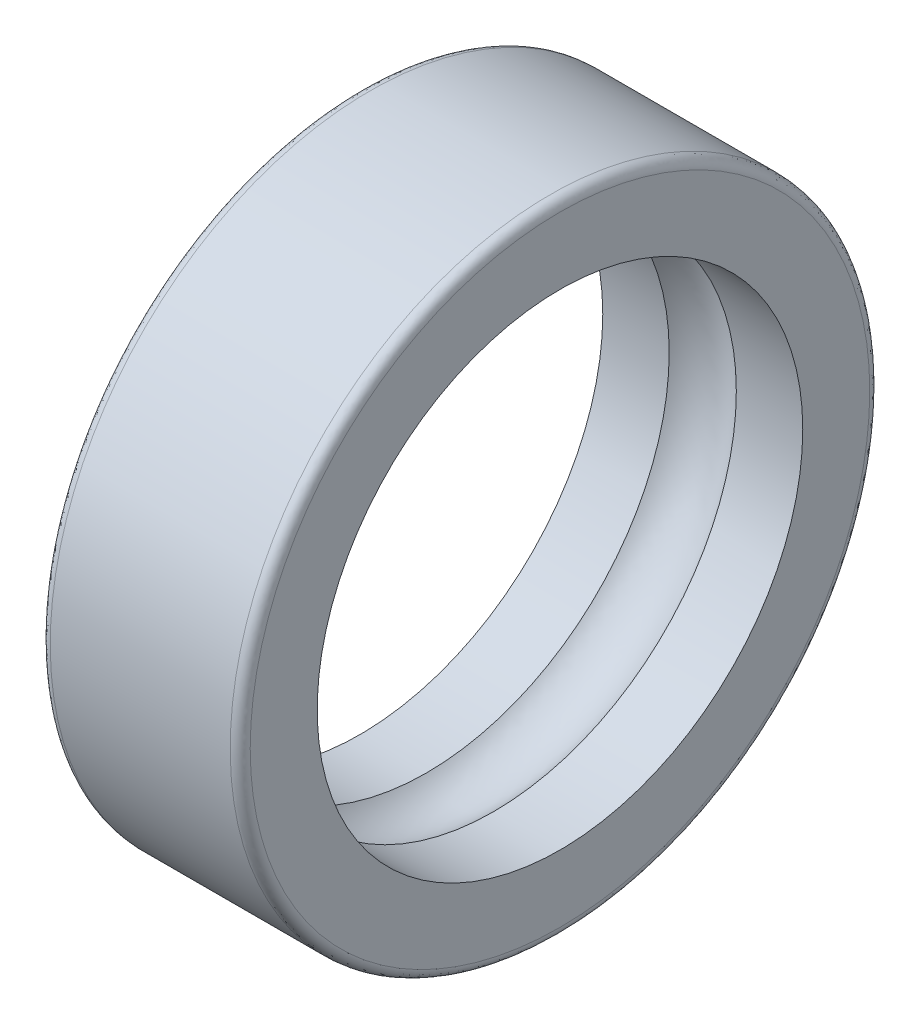
ISO-10303-21;
HEADER;
FILE_DESCRIPTION(('STEP AP214'),'2;1');
FILE_NAME('part.step','',(''),(''),'','','');
FILE_SCHEMA(('AUTOMOTIVE_DESIGN { 1 0 10303 214 1 1 1 1 }'));
ENDSEC;
DATA;
#1=APPLICATION_CONTEXT('core data for automotive mechanical design processes');
#2=APPLICATION_PROTOCOL_DEFINITION('international standard','automotive_design',2000,#1);
#3=PRODUCT_CONTEXT('',#1,'mechanical');
#4=PRODUCT('Part','Part','',(#3));
#5=PRODUCT_RELATED_PRODUCT_CATEGORY('part','',(#4));
#6=PRODUCT_DEFINITION_FORMATION('','',#4);
#7=PRODUCT_DEFINITION_CONTEXT('part definition',#1,'design');
#8=PRODUCT_DEFINITION('design','',#6,#7);
#9=PRODUCT_DEFINITION_SHAPE('','',#8);
#10=(LENGTH_UNIT() NAMED_UNIT(*) SI_UNIT(.MILLI.,.METRE.));
#11=(NAMED_UNIT(*) PLANE_ANGLE_UNIT() SI_UNIT($,.RADIAN.));
#12=(NAMED_UNIT(*) SI_UNIT($,.STERADIAN.) SOLID_ANGLE_UNIT());
#13=UNCERTAINTY_MEASURE_WITH_UNIT(LENGTH_MEASURE(1.E-05),#10,'distance_accuracy_value','');
#14=(GEOMETRIC_REPRESENTATION_CONTEXT(3) GLOBAL_UNCERTAINTY_ASSIGNED_CONTEXT((#13)) GLOBAL_UNIT_ASSIGNED_CONTEXT((#10,
#11,#12)) REPRESENTATION_CONTEXT('',''));
#15=CARTESIAN_POINT('',(0.,0.,0.));
#16=DIRECTION('',(0.,0.,1.));
#17=DIRECTION('',(1.,0.,0.));
#18=AXIS2_PLACEMENT_3D('',#15,#16,#17);
#19=CARTESIAN_POINT('',(-2.25171,0.,0.));
#20=DIRECTION('',(1.,0.,0.));
#21=DIRECTION('',(0.,0.,-1.));
#22=AXIS2_PLACEMENT_3D('',#19,#20,#21);
#23=CYLINDRICAL_SURFACE('',#22,8.001);
#24=CARTESIAN_POINT('',(2.25171,0.,0.));
#25=DIRECTION('',(1.,0.,0.));
#26=DIRECTION('',(0.,-1.,0.));
#27=AXIS2_PLACEMENT_3D('',#24,#25,#26);
#28=CIRCLE('',#27,8.00099999999999);
#29=CARTESIAN_POINT('',(2.25171,-8.00099999999999,0.));
#30=VERTEX_POINT('',#29);
#31=EDGE_CURVE('E106',#30,#30,#28,.F.);
#32=ORIENTED_EDGE('',*,*,#31,.T.);
#33=EDGE_LOOP('',(#32));
#34=FACE_BOUND('',#33,.T.);
#35=CARTESIAN_POINT('',(-2.25171,0.,0.));
#36=DIRECTION('',(1.,0.,0.));
#37=DIRECTION('',(0.,-1.,0.));
#38=AXIS2_PLACEMENT_3D('',#35,#36,#37);
#39=CIRCLE('',#38,8.00099999999999);
#40=CARTESIAN_POINT('',(-2.25171,-8.00099999999999,0.));
#41=VERTEX_POINT('',#40);
#42=EDGE_CURVE('E54',#41,#41,#39,.T.);
#43=ORIENTED_EDGE('',*,*,#42,.T.);
#44=EDGE_LOOP('',(#43));
#45=FACE_BOUND('',#44,.T.);
#46=ADVANCED_FACE('F17',(#34,#45),#23,.T.);
#47=CARTESIAN_POINT('',(2.223955035402,-7.99945572797488,0.));
#48=CARTESIAN_POINT('',(2.39671908490918,-8.01874043524467,0.));
#49=CARTESIAN_POINT('',(2.51964043524467,-7.89581908490918,0.));
#50=CARTESIAN_POINT('',(2.50035572797488,-7.723055035402,0.));
#51=(BOUNDED_CURVE() B_SPLINE_CURVE(3,(#47,#48,#49,#50),.UNSPECIFIED.,.F.,
.F.) B_SPLINE_CURVE_WITH_KNOTS((4,4),(0.,1.),
.UNSPECIFIED.) CURVE() GEOMETRIC_REPRESENTATION_ITEM() RATIONAL_B_SPLINE_CURVE((1.,
0.749532639687892,0.749532639687892,1.)) REPRESENTATION_ITEM(''));
#52=CARTESIAN_POINT('',(2.25171,0.,0.));
#53=DIRECTION('',(1.,0.,0.));
#54=AXIS1_PLACEMENT('',#52,#53);
#55=SURFACE_OF_REVOLUTION('',#51,#54);
#56=ORIENTED_EDGE('',*,*,#31,.F.);
#57=EDGE_LOOP('',(#56));
#58=FACE_BOUND('',#57,.T.);
#59=CARTESIAN_POINT('',(2.50189999999999,0.,0.));
#60=DIRECTION('',(-1.,0.,0.));
#61=DIRECTION('',(0.,1.,0.));
#62=AXIS2_PLACEMENT_3D('',#59,#60,#61);
#63=CIRCLE('',#62,7.75081);
#64=CARTESIAN_POINT('',(2.50189999999999,7.75081,0.));
#65=VERTEX_POINT('',#64);
#66=CARTESIAN_POINT('',(2.50189999999999,-7.75081,0.));
#67=VERTEX_POINT('',#66);
#68=EDGE_CURVE('E47',#65,#67,#63,.T.);
#69=ORIENTED_EDGE('',*,*,#68,.T.);
#70=CARTESIAN_POINT('',(2.50189999999999,0.,0.));
#71=DIRECTION('',(-1.,0.,0.));
#72=DIRECTION('',(0.,-1.,0.));
#73=AXIS2_PLACEMENT_3D('',#70,#71,#72);
#74=CIRCLE('',#73,7.75081);
#75=EDGE_CURVE('E50',#67,#65,#74,.T.);
#76=ORIENTED_EDGE('',*,*,#75,.T.);
#77=EDGE_LOOP('',(#69,#76));
#78=FACE_BOUND('',#77,.T.);
#79=ADVANCED_FACE('F51',(#58,#78),#55,.T.);
#80=CARTESIAN_POINT('',(-2.50035572797488,-7.723055035402,0.));
#81=CARTESIAN_POINT('',(-2.51964043524467,-7.89581908490918,0.));
#82=CARTESIAN_POINT('',(-2.39671908490918,-8.01874043524467,0.));
#83=CARTESIAN_POINT('',(-2.223955035402,-7.99945572797488,0.));
#84=(BOUNDED_CURVE() B_SPLINE_CURVE(3,(#80,#81,#82,#83),.UNSPECIFIED.,.F.,
.F.) B_SPLINE_CURVE_WITH_KNOTS((4,4),(0.,1.),
.UNSPECIFIED.) CURVE() GEOMETRIC_REPRESENTATION_ITEM() RATIONAL_B_SPLINE_CURVE((1.,
0.749532639687893,0.749532639687893,1.)) REPRESENTATION_ITEM(''));
#85=CARTESIAN_POINT('',(-2.25171,0.,0.));
#86=DIRECTION('',(1.,0.,0.));
#87=AXIS1_PLACEMENT('',#85,#86);
#88=SURFACE_OF_REVOLUTION('',#84,#87);
#89=ORIENTED_EDGE('',*,*,#42,.F.);
#90=EDGE_LOOP('',(#89));
#91=FACE_BOUND('',#90,.T.);
#92=CARTESIAN_POINT('',(-2.50189999999999,0.,0.));
#93=DIRECTION('',(1.,0.,0.));
#94=DIRECTION('',(0.,1.,0.));
#95=AXIS2_PLACEMENT_3D('',#92,#93,#94);
#96=CIRCLE('',#95,7.75081);
#97=CARTESIAN_POINT('',(-2.50189999999999,7.75081,0.));
#98=VERTEX_POINT('',#97);
#99=CARTESIAN_POINT('',(-2.50189999999999,-7.75081,0.));
#100=VERTEX_POINT('',#99);
#101=EDGE_CURVE('E113',#98,#100,#96,.T.);
#102=ORIENTED_EDGE('',*,*,#101,.T.);
#103=CARTESIAN_POINT('',(-2.50189999999999,0.,0.));
#104=DIRECTION('',(1.,0.,0.));
#105=DIRECTION('',(0.,-1.,0.));
#106=AXIS2_PLACEMENT_3D('',#103,#104,#105);
#107=CIRCLE('',#106,7.75081);
#108=EDGE_CURVE('E38',#100,#98,#107,.T.);
#109=ORIENTED_EDGE('',*,*,#108,.T.);
#110=EDGE_LOOP('',(#102,#109));
#111=FACE_BOUND('',#110,.T.);
#112=ADVANCED_FACE('F74',(#91,#111),#88,.T.);
#113=CARTESIAN_POINT('',(2.5019,8.0608424,8.06392032693786));
#114=DIRECTION('',(1.,0.,0.));
#115=DIRECTION('',(0.,-1.,0.));
#116=AXIS2_PLACEMENT_3D('',#113,#114,#115);
#117=PLANE('',#116);
#118=CARTESIAN_POINT('',(2.5019,0.,0.));
#119=DIRECTION('',(1.,0.,0.));
#120=DIRECTION('',(0.,0.,-1.));
#121=AXIS2_PLACEMENT_3D('',#118,#119,#120);
#122=CIRCLE('',#121,6.0745751);
#123=CARTESIAN_POINT('',(2.5019,0.,-6.0745751));
#124=VERTEX_POINT('',#123);
#125=EDGE_CURVE('E117',#124,#124,#122,.F.);
#126=ORIENTED_EDGE('',*,*,#125,.T.);
#127=EDGE_LOOP('',(#126));
#128=FACE_BOUND('',#127,.T.);
#129=ORIENTED_EDGE('',*,*,#75,.F.);
#130=ORIENTED_EDGE('',*,*,#68,.F.);
#131=EDGE_LOOP('',(#129,#130));
#132=FACE_BOUND('',#131,.T.);
#133=ADVANCED_FACE('F57',(#128,#132),#117,.T.);
#134=CARTESIAN_POINT('',(-2.5019,8.0608424,8.06392032693786));
#135=DIRECTION('',(1.,0.,0.));
#136=DIRECTION('',(0.,-1.,0.));
#137=AXIS2_PLACEMENT_3D('',#134,#135,#136);
#138=PLANE('',#137);
#139=CARTESIAN_POINT('',(-2.5019,0.,0.));
#140=DIRECTION('',(1.,0.,0.));
#141=DIRECTION('',(0.,0.,-1.));
#142=AXIS2_PLACEMENT_3D('',#139,#140,#141);
#143=CIRCLE('',#142,6.0745751);
#144=CARTESIAN_POINT('',(-2.5019,0.,-6.0745751));
#145=VERTEX_POINT('',#144);
#146=EDGE_CURVE('E148',#145,#145,#143,.T.);
#147=ORIENTED_EDGE('',*,*,#146,.T.);
#148=EDGE_LOOP('',(#147));
#149=FACE_BOUND('',#148,.T.);
#150=ORIENTED_EDGE('',*,*,#108,.F.);
#151=ORIENTED_EDGE('',*,*,#101,.F.);
#152=EDGE_LOOP('',(#150,#151));
#153=FACE_BOUND('',#152,.T.);
#154=ADVANCED_FACE('F19',(#149,#153),#138,.F.);
#155=CARTESIAN_POINT('',(0.839755569912476,0.,0.));
#156=DIRECTION('',(1.,0.,0.));
#157=DIRECTION('',(0.,0.,-1.));
#158=AXIS2_PLACEMENT_3D('',#155,#156,#157);
#159=CYLINDRICAL_SURFACE('',#158,6.0745751);
#160=ORIENTED_EDGE('',*,*,#125,.F.);
#161=EDGE_LOOP('',(#160));
#162=FACE_BOUND('',#161,.T.);
#163=CARTESIAN_POINT('',(0.839755569912455,0.,0.));
#164=DIRECTION('',(1.,0.,0.));
#165=DIRECTION('',(0.,-1.,0.));
#166=AXIS2_PLACEMENT_3D('',#163,#164,#165);
#167=CIRCLE('',#166,6.07457509999998);
#168=CARTESIAN_POINT('',(0.839755569912455,-6.07457509999998,0.));
#169=VERTEX_POINT('',#168);
#170=EDGE_CURVE('E30',#169,#169,#167,.F.);
#171=ORIENTED_EDGE('',*,*,#170,.T.);
#172=EDGE_LOOP('',(#171));
#173=FACE_BOUND('',#172,.T.);
#174=ADVANCED_FACE('F119',(#162,#173),#159,.F.);
#175=CARTESIAN_POINT('',(-2.5019,0.,0.));
#176=DIRECTION('',(1.,0.,0.));
#177=DIRECTION('',(0.,0.,-1.));
#178=AXIS2_PLACEMENT_3D('',#175,#176,#177);
#179=CYLINDRICAL_SURFACE('',#178,6.0745751);
#180=ORIENTED_EDGE('',*,*,#146,.F.);
#181=EDGE_LOOP('',(#180));
#182=FACE_BOUND('',#181,.T.);
#183=CARTESIAN_POINT('',(-0.839755569912455,0.,0.));
#184=DIRECTION('',(1.,0.,0.));
#185=DIRECTION('',(0.,-1.,0.));
#186=AXIS2_PLACEMENT_3D('',#183,#184,#185);
#187=CIRCLE('',#186,6.07457509999998);
#188=CARTESIAN_POINT('',(-0.839755569912455,-6.07457509999998,0.));
#189=VERTEX_POINT('',#188);
#190=EDGE_CURVE('E11',#189,#189,#187,.T.);
#191=ORIENTED_EDGE('',*,*,#190,.T.);
#192=EDGE_LOOP('',(#191));
#193=FACE_BOUND('',#192,.T.);
#194=ADVANCED_FACE('F125',(#182,#193),#179,.F.);
#195=CARTESIAN_POINT('',(-0.865514674075644,-6.0474454123038,0.));
#196=CARTESIAN_POINT('',(-0.367700637430904,-6.58873666476194,0.));
#197=CARTESIAN_POINT('',(0.367700637430802,-6.58873666476196,0.));
#198=CARTESIAN_POINT('',(0.865514674075583,-6.04744541230387,0.));
#199=(BOUNDED_CURVE() B_SPLINE_CURVE(3,(#195,#196,#197,#198),.UNSPECIFIED.,.F.,
.F.) B_SPLINE_CURVE_WITH_KNOTS((4,4),(0.,1.),
.UNSPECIFIED.) CURVE() GEOMETRIC_REPRESENTATION_ITEM() RATIONAL_B_SPLINE_CURVE((1.,
0.784618958983424,0.784618958983424,1.)) REPRESENTATION_ITEM(''));
#200=CARTESIAN_POINT('',(0.,0.,0.));
#201=DIRECTION('',(1.,0.,0.));
#202=AXIS1_PLACEMENT('',#200,#201);
#203=SURFACE_OF_REVOLUTION('',#199,#202);
#204=ORIENTED_EDGE('',*,*,#170,.F.);
#205=EDGE_LOOP('',(#204));
#206=FACE_BOUND('',#205,.T.);
#207=ORIENTED_EDGE('',*,*,#190,.F.);
#208=EDGE_LOOP('',(#207));
#209=FACE_BOUND('',#208,.T.);
#210=ADVANCED_FACE('F128',(#206,#209),#203,.F.);
#211=CLOSED_SHELL('',(#46,#79,#112,#133,#154,#174,#194,#210));
#212=MANIFOLD_SOLID_BREP('B1',#211);
#213=ADVANCED_BREP_SHAPE_REPRESENTATION('',(#18,#212),#14);
#214=SHAPE_DEFINITION_REPRESENTATION(#9,#213);
ENDSEC;
END-ISO-10303-21;
